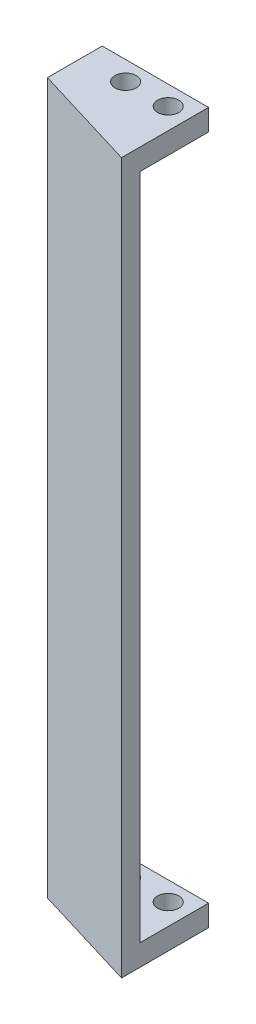
ISO-10303-21;
HEADER;
FILE_DESCRIPTION(('STEP AP214'),'2;1');
FILE_NAME('part.step','',(''),(''),'','','');
FILE_SCHEMA(('AUTOMOTIVE_DESIGN { 1 0 10303 214 1 1 1 1 }'));
ENDSEC;
DATA;
#1=APPLICATION_CONTEXT('core data for automotive mechanical design processes');
#2=APPLICATION_PROTOCOL_DEFINITION('international standard','automotive_design',2000,#1);
#3=PRODUCT_CONTEXT('',#1,'mechanical');
#4=PRODUCT('Part','Part','',(#3));
#5=PRODUCT_RELATED_PRODUCT_CATEGORY('part','',(#4));
#6=PRODUCT_DEFINITION_FORMATION('','',#4);
#7=PRODUCT_DEFINITION_CONTEXT('part definition',#1,'design');
#8=PRODUCT_DEFINITION('design','',#6,#7);
#9=PRODUCT_DEFINITION_SHAPE('','',#8);
#10=(LENGTH_UNIT() NAMED_UNIT(*) SI_UNIT(.MILLI.,.METRE.));
#11=(NAMED_UNIT(*) PLANE_ANGLE_UNIT() SI_UNIT($,.RADIAN.));
#12=(NAMED_UNIT(*) SI_UNIT($,.STERADIAN.) SOLID_ANGLE_UNIT());
#13=UNCERTAINTY_MEASURE_WITH_UNIT(LENGTH_MEASURE(1.E-05),#10,'distance_accuracy_value','');
#14=(GEOMETRIC_REPRESENTATION_CONTEXT(3) GLOBAL_UNCERTAINTY_ASSIGNED_CONTEXT((#13)) GLOBAL_UNIT_ASSIGNED_CONTEXT((#10,
#11,#12)) REPRESENTATION_CONTEXT('',''));
#15=CARTESIAN_POINT('',(0.,0.,0.));
#16=DIRECTION('',(0.,0.,1.));
#17=DIRECTION('',(1.,0.,0.));
#18=AXIS2_PLACEMENT_3D('',#15,#16,#17);
#19=CARTESIAN_POINT('',(0.,3.,0.));
#20=DIRECTION('',(0.,1.,0.));
#21=DIRECTION('',(0.,0.,1.));
#22=AXIS2_PLACEMENT_3D('',#19,#20,#21);
#23=PLANE('',#22);
#24=CARTESIAN_POINT('',(-54.587954734642,3.,-0.793737974361889));
#25=DIRECTION('',(0.,1.,0.));
#26=DIRECTION('',(0.,0.,1.));
#27=AXIS2_PLACEMENT_3D('',#24,#25,#26);
#28=CIRCLE('',#27,1.5);
#29=CARTESIAN_POINT('',(-54.587954734642,3.,0.706262025638108));
#30=VERTEX_POINT('',#29);
#31=EDGE_CURVE('E160',#30,#30,#28,.T.);
#32=ORIENTED_EDGE('',*,*,#31,.F.);
#33=EDGE_LOOP('',(#32));
#34=FACE_BOUND('',#33,.T.);
#35=CARTESIAN_POINT('',(-60.587954734642,3.,-0.793737974361892));
#36=DIRECTION('',(0.,1.,0.));
#37=DIRECTION('',(0.,0.,1.));
#38=AXIS2_PLACEMENT_3D('',#35,#36,#37);
#39=CIRCLE('',#38,1.5);
#40=CARTESIAN_POINT('',(-60.587954734642,3.,0.706262025638105));
#41=VERTEX_POINT('',#40);
#42=EDGE_CURVE('E186',#41,#41,#39,.T.);
#43=ORIENTED_EDGE('',*,*,#42,.F.);
#44=EDGE_LOOP('',(#43));
#45=FACE_BOUND('',#44,.T.);
#46=DIRECTION('',(0.,0.,-1.));
#47=VECTOR('',#46,1.);
#48=CARTESIAN_POINT('',(-64.087954734642,3.,0.));
#49=LINE('',#48,#47);
#50=CARTESIAN_POINT('',(-64.087954734642,3.,2.35261604001609));
#51=VERTEX_POINT('',#50);
#52=CARTESIAN_POINT('',(-64.087954734642,3.,-3.50264174190361));
#53=VERTEX_POINT('',#52);
#54=EDGE_CURVE('E52',#51,#53,#49,.T.);
#55=ORIENTED_EDGE('',*,*,#54,.F.);
#56=DIRECTION('',(0.956868329183458,0.,0.290521945136091));
#57=VECTOR('',#56,1.);
#58=CARTESIAN_POINT('',(-6.06322235186159,3.,19.9699387203809));
#59=LINE('',#58,#57);
#60=CARTESIAN_POINT('',(-51.6186700200398,3.,6.13850876867741));
#61=VERTEX_POINT('',#60);
#62=EDGE_CURVE('E57',#51,#61,#59,.T.);
#63=ORIENTED_EDGE('',*,*,#62,.T.);
#64=DIRECTION('',(0.,0.,-1.));
#65=VECTOR('',#64,1.);
#66=CARTESIAN_POINT('',(-51.6186700200398,3.,8.75119843950533));
#67=LINE('',#66,#65);
#68=CARTESIAN_POINT('',(-51.6186700200398,3.,-3.50264174190359));
#69=VERTEX_POINT('',#68);
#70=EDGE_CURVE('E174',#61,#69,#67,.T.);
#71=ORIENTED_EDGE('',*,*,#70,.T.);
#72=DIRECTION('',(-1.,0.,0.));
#73=VECTOR('',#72,1.);
#74=CARTESIAN_POINT('',(-51.6186700200398,3.,-3.50264174190359));
#75=LINE('',#74,#73);
#76=EDGE_CURVE('E177',#69,#53,#75,.T.);
#77=ORIENTED_EDGE('',*,*,#76,.T.);
#78=EDGE_LOOP('',(#55,#63,#71,#77));
#79=FACE_BOUND('',#78,.T.);
#80=ADVANCED_FACE('F35',(#34,#45,#79),#23,.T.);
#81=CARTESIAN_POINT('',(0.,0.,0.));
#82=DIRECTION('',(0.,1.,0.));
#83=DIRECTION('',(0.,0.,1.));
#84=AXIS2_PLACEMENT_3D('',#81,#82,#83);
#85=PLANE('',#84);
#86=DIRECTION('',(0.956868329183458,0.,0.290521945136091));
#87=VECTOR('',#86,1.);
#88=CARTESIAN_POINT('',(-66.587954734642,0.,4.20626202563812));
#89=LINE('',#88,#87);
#90=CARTESIAN_POINT('',(-66.587954734642,0.,4.20626202563812));
#91=VERTEX_POINT('',#90);
#92=CARTESIAN_POINT('',(-51.6186700200398,0.,8.75119843950533));
#93=VERTEX_POINT('',#92);
#94=EDGE_CURVE('E156',#91,#93,#89,.T.);
#95=ORIENTED_EDGE('',*,*,#94,.F.);
#96=DIRECTION('',(0.,0.,1.));
#97=VECTOR('',#96,1.);
#98=CARTESIAN_POINT('',(-66.587954734642,0.,-3.50264174190362));
#99=LINE('',#98,#97);
#100=CARTESIAN_POINT('',(-66.587954734642,0.,-3.50264174190362));
#101=VERTEX_POINT('',#100);
#102=EDGE_CURVE('E172',#101,#91,#99,.T.);
#103=ORIENTED_EDGE('',*,*,#102,.F.);
#104=DIRECTION('',(-1.,0.,0.));
#105=VECTOR('',#104,1.);
#106=CARTESIAN_POINT('',(-51.6186700200398,0.,-3.50264174190359));
#107=LINE('',#106,#105);
#108=CARTESIAN_POINT('',(-51.6186700200398,0.,-3.50264174190359));
#109=VERTEX_POINT('',#108);
#110=EDGE_CURVE('E162',#109,#101,#107,.T.);
#111=ORIENTED_EDGE('',*,*,#110,.F.);
#112=DIRECTION('',(0.,0.,-1.));
#113=VECTOR('',#112,1.);
#114=CARTESIAN_POINT('',(-51.6186700200398,0.,8.75119843950533));
#115=LINE('',#114,#113);
#116=EDGE_CURVE('E151',#93,#109,#115,.T.);
#117=ORIENTED_EDGE('',*,*,#116,.F.);
#118=EDGE_LOOP('',(#95,#103,#111,#117));
#119=FACE_BOUND('',#118,.T.);
#120=CARTESIAN_POINT('',(-54.587954734642,0.,-0.793737974361889));
#121=DIRECTION('',(0.,1.,0.));
#122=DIRECTION('',(0.,0.,1.));
#123=AXIS2_PLACEMENT_3D('',#120,#121,#122);
#124=CIRCLE('',#123,1.5);
#125=CARTESIAN_POINT('',(-54.587954734642,0.,0.706262025638108));
#126=VERTEX_POINT('',#125);
#127=EDGE_CURVE('E165',#126,#126,#124,.T.);
#128=ORIENTED_EDGE('',*,*,#127,.T.);
#129=EDGE_LOOP('',(#128));
#130=FACE_BOUND('',#129,.T.);
#131=CARTESIAN_POINT('',(-60.587954734642,0.,-0.793737974361892));
#132=DIRECTION('',(0.,1.,0.));
#133=DIRECTION('',(0.,0.,1.));
#134=AXIS2_PLACEMENT_3D('',#131,#132,#133);
#135=CIRCLE('',#134,1.5);
#136=CARTESIAN_POINT('',(-60.587954734642,0.,0.706262025638105));
#137=VERTEX_POINT('',#136);
#138=EDGE_CURVE('E188',#137,#137,#135,.T.);
#139=ORIENTED_EDGE('',*,*,#138,.T.);
#140=EDGE_LOOP('',(#139));
#141=FACE_BOUND('',#140,.T.);
#142=ADVANCED_FACE('F216',(#119,#130,#141),#85,.F.);
#143=CARTESIAN_POINT('',(-66.587954734642,3.,4.20626202563812));
#144=DIRECTION('',(0.290521945136091,0.,-0.956868329183458));
#145=DIRECTION('',(-0.956868329183458,0.,-0.290521945136091));
#146=AXIS2_PLACEMENT_3D('',#143,#144,#145);
#147=PLANE('',#146);
#148=ORIENTED_EDGE('',*,*,#94,.T.);
#149=DIRECTION('',(0.,-1.,0.));
#150=VECTOR('',#149,1.);
#151=CARTESIAN_POINT('',(-51.6186700200398,3.,8.75119843950533));
#152=LINE('',#151,#150);
#153=CARTESIAN_POINT('',(-51.6186700200398,100.,8.75119843950533));
#154=VERTEX_POINT('',#153);
#155=EDGE_CURVE('E11',#154,#93,#152,.T.);
#156=ORIENTED_EDGE('',*,*,#155,.F.);
#157=DIRECTION('',(0.956868329183458,0.,0.290521945136091));
#158=VECTOR('',#157,1.);
#159=CARTESIAN_POINT('',(-66.587954734642,100.,4.20626202563812));
#160=LINE('',#159,#158);
#161=CARTESIAN_POINT('',(-66.587954734642,100.,4.20626202563812));
#162=VERTEX_POINT('',#161);
#163=EDGE_CURVE('E138',#162,#154,#160,.T.);
#164=ORIENTED_EDGE('',*,*,#163,.F.);
#165=DIRECTION('',(0.,-1.,0.));
#166=VECTOR('',#165,1.);
#167=CARTESIAN_POINT('',(-66.587954734642,3.,4.20626202563812));
#168=LINE('',#167,#166);
#169=EDGE_CURVE('E157',#162,#91,#168,.T.);
#170=ORIENTED_EDGE('',*,*,#169,.T.);
#171=EDGE_LOOP('',(#148,#156,#164,#170));
#172=FACE_BOUND('',#171,.T.);
#173=ADVANCED_FACE('F37',(#172),#147,.F.);
#174=CARTESIAN_POINT('',(-51.6186700200398,3.,8.75119843950533));
#175=DIRECTION('',(-1.,0.,0.));
#176=DIRECTION('',(0.,0.,1.));
#177=AXIS2_PLACEMENT_3D('',#174,#175,#176);
#178=PLANE('',#177);
#179=ORIENTED_EDGE('',*,*,#116,.T.);
#180=DIRECTION('',(0.,-1.,0.));
#181=VECTOR('',#180,1.);
#182=CARTESIAN_POINT('',(-51.6186700200398,3.,-3.50264174190359));
#183=LINE('',#182,#181);
#184=EDGE_CURVE('E44',#69,#109,#183,.T.);
#185=ORIENTED_EDGE('',*,*,#184,.F.);
#186=ORIENTED_EDGE('',*,*,#70,.F.);
#187=DIRECTION('',(0.,-1.,0.));
#188=VECTOR('',#187,1.);
#189=CARTESIAN_POINT('',(-51.6186700200398,97.,6.13850876867741));
#190=LINE('',#189,#188);
#191=CARTESIAN_POINT('',(-51.6186700200398,97.,6.13850876867741));
#192=VERTEX_POINT('',#191);
#193=EDGE_CURVE('E107',#192,#61,#190,.T.);
#194=ORIENTED_EDGE('',*,*,#193,.F.);
#195=DIRECTION('',(0.,0.,-1.));
#196=VECTOR('',#195,1.);
#197=CARTESIAN_POINT('',(-51.6186700200398,97.,8.75119843950533));
#198=LINE('',#197,#196);
#199=CARTESIAN_POINT('',(-51.6186700200398,97.,-3.50264174190359));
#200=VERTEX_POINT('',#199);
#201=EDGE_CURVE('E100',#192,#200,#198,.T.);
#202=ORIENTED_EDGE('',*,*,#201,.T.);
#203=DIRECTION('',(0.,1.,0.));
#204=VECTOR('',#203,1.);
#205=CARTESIAN_POINT('',(-51.6186700200398,97.,-3.50264174190359));
#206=LINE('',#205,#204);
#207=CARTESIAN_POINT('',(-51.6186700200398,100.,-3.50264174190359));
#208=VERTEX_POINT('',#207);
#209=EDGE_CURVE('E104',#200,#208,#206,.T.);
#210=ORIENTED_EDGE('',*,*,#209,.T.);
#211=DIRECTION('',(0.,0.,-1.));
#212=VECTOR('',#211,1.);
#213=CARTESIAN_POINT('',(-51.6186700200398,100.,8.75119843950533));
#214=LINE('',#213,#212);
#215=EDGE_CURVE('E126',#154,#208,#214,.T.);
#216=ORIENTED_EDGE('',*,*,#215,.F.);
#217=ORIENTED_EDGE('',*,*,#155,.T.);
#218=EDGE_LOOP('',(#179,#185,#186,#194,#202,#210,#216,#217));
#219=FACE_BOUND('',#218,.T.);
#220=ADVANCED_FACE('F102',(#219),#178,.F.);
#221=CARTESIAN_POINT('',(-51.6186700200398,3.,-3.50264174190359));
#222=DIRECTION('',(0.,0.,1.));
#223=DIRECTION('',(1.,0.,0.));
#224=AXIS2_PLACEMENT_3D('',#221,#222,#223);
#225=PLANE('',#224);
#226=ORIENTED_EDGE('',*,*,#110,.T.);
#227=DIRECTION('',(0.,-1.,0.));
#228=VECTOR('',#227,1.);
#229=CARTESIAN_POINT('',(-66.587954734642,3.,-3.50264174190362));
#230=LINE('',#229,#228);
#231=CARTESIAN_POINT('',(-66.587954734642,100.,-3.50264174190362));
#232=VERTEX_POINT('',#231);
#233=EDGE_CURVE('E176',#232,#101,#230,.T.);
#234=ORIENTED_EDGE('',*,*,#233,.F.);
#235=DIRECTION('',(-1.,0.,0.));
#236=VECTOR('',#235,1.);
#237=CARTESIAN_POINT('',(-51.6186700200398,100.,-3.50264174190359));
#238=LINE('',#237,#236);
#239=EDGE_CURVE('E119',#208,#232,#238,.T.);
#240=ORIENTED_EDGE('',*,*,#239,.F.);
#241=ORIENTED_EDGE('',*,*,#209,.F.);
#242=DIRECTION('',(-1.,0.,0.));
#243=VECTOR('',#242,1.);
#244=CARTESIAN_POINT('',(-51.6186700200398,97.,-3.50264174190359));
#245=LINE('',#244,#243);
#246=CARTESIAN_POINT('',(-64.087954734642,97.,-3.50264174190361));
#247=VERTEX_POINT('',#246);
#248=EDGE_CURVE('E112',#200,#247,#245,.T.);
#249=ORIENTED_EDGE('',*,*,#248,.T.);
#250=DIRECTION('',(0.,-1.,0.));
#251=VECTOR('',#250,1.);
#252=CARTESIAN_POINT('',(-64.087954734642,97.,-3.50264174190361));
#253=LINE('',#252,#251);
#254=EDGE_CURVE('E195',#247,#53,#253,.T.);
#255=ORIENTED_EDGE('',*,*,#254,.T.);
#256=ORIENTED_EDGE('',*,*,#76,.F.);
#257=ORIENTED_EDGE('',*,*,#184,.T.);
#258=EDGE_LOOP('',(#226,#234,#240,#241,#249,#255,#256,#257));
#259=FACE_BOUND('',#258,.T.);
#260=ADVANCED_FACE('F116',(#259),#225,.F.);
#261=CARTESIAN_POINT('',(-66.587954734642,3.,-3.50264174190362));
#262=DIRECTION('',(1.,0.,0.));
#263=DIRECTION('',(0.,0.,-1.));
#264=AXIS2_PLACEMENT_3D('',#261,#262,#263);
#265=PLANE('',#264);
#266=ORIENTED_EDGE('',*,*,#102,.T.);
#267=ORIENTED_EDGE('',*,*,#169,.F.);
#268=DIRECTION('',(0.,0.,1.));
#269=VECTOR('',#268,1.);
#270=CARTESIAN_POINT('',(-66.587954734642,100.,-3.50264174190362));
#271=LINE('',#270,#269);
#272=EDGE_CURVE('E141',#232,#162,#271,.T.);
#273=ORIENTED_EDGE('',*,*,#272,.F.);
#274=ORIENTED_EDGE('',*,*,#233,.T.);
#275=EDGE_LOOP('',(#266,#267,#273,#274));
#276=FACE_BOUND('',#275,.T.);
#277=ADVANCED_FACE('F229',(#276),#265,.F.);
#278=CARTESIAN_POINT('',(-54.587954734642,3.,-0.793737974361889));
#279=DIRECTION('',(0.,-1.,0.));
#280=DIRECTION('',(0.,0.,-1.));
#281=AXIS2_PLACEMENT_3D('',#278,#279,#280);
#282=CYLINDRICAL_SURFACE('',#281,1.5);
#283=ORIENTED_EDGE('',*,*,#31,.T.);
#284=EDGE_LOOP('',(#283));
#285=FACE_BOUND('',#284,.T.);
#286=ORIENTED_EDGE('',*,*,#127,.F.);
#287=EDGE_LOOP('',(#286));
#288=FACE_BOUND('',#287,.T.);
#289=ADVANCED_FACE('F226',(#285,#288),#282,.F.);
#290=CARTESIAN_POINT('',(-60.587954734642,3.,-0.793737974361892));
#291=DIRECTION('',(0.,-1.,0.));
#292=DIRECTION('',(0.,0.,-1.));
#293=AXIS2_PLACEMENT_3D('',#290,#291,#292);
#294=CYLINDRICAL_SURFACE('',#293,1.5);
#295=ORIENTED_EDGE('',*,*,#42,.T.);
#296=EDGE_LOOP('',(#295));
#297=FACE_BOUND('',#296,.T.);
#298=ORIENTED_EDGE('',*,*,#138,.F.);
#299=EDGE_LOOP('',(#298));
#300=FACE_BOUND('',#299,.T.);
#301=ADVANCED_FACE('F254',(#297,#300),#294,.F.);
#302=CARTESIAN_POINT('',(-6.06322235186159,97.,19.9699387203809));
#303=DIRECTION('',(0.290521945136091,0.,-0.956868329183458));
#304=DIRECTION('',(-0.956868329183458,0.,-0.290521945136091));
#305=AXIS2_PLACEMENT_3D('',#302,#303,#304);
#306=PLANE('',#305);
#307=ORIENTED_EDGE('',*,*,#62,.F.);
#308=DIRECTION('',(0.,-1.,0.));
#309=VECTOR('',#308,1.);
#310=CARTESIAN_POINT('',(-64.087954734642,97.,2.35261604001609));
#311=LINE('',#310,#309);
#312=CARTESIAN_POINT('',(-64.087954734642,97.,2.35261604001609));
#313=VERTEX_POINT('',#312);
#314=EDGE_CURVE('E191',#313,#51,#311,.T.);
#315=ORIENTED_EDGE('',*,*,#314,.F.);
#316=DIRECTION('',(0.956868329183458,0.,0.290521945136091));
#317=VECTOR('',#316,1.);
#318=CARTESIAN_POINT('',(-6.06322235186159,97.,19.9699387203809));
#319=LINE('',#318,#317);
#320=EDGE_CURVE('E199',#313,#192,#319,.T.);
#321=ORIENTED_EDGE('',*,*,#320,.T.);
#322=ORIENTED_EDGE('',*,*,#193,.T.);
#323=EDGE_LOOP('',(#307,#315,#321,#322));
#324=FACE_BOUND('',#323,.T.);
#325=ADVANCED_FACE('F210',(#324),#306,.T.);
#326=CARTESIAN_POINT('',(-64.087954734642,97.,0.));
#327=DIRECTION('',(-1.,0.,0.));
#328=DIRECTION('',(0.,0.,1.));
#329=AXIS2_PLACEMENT_3D('',#326,#327,#328);
#330=PLANE('',#329);
#331=ORIENTED_EDGE('',*,*,#54,.T.);
#332=ORIENTED_EDGE('',*,*,#254,.F.);
#333=DIRECTION('',(0.,0.,-1.));
#334=VECTOR('',#333,1.);
#335=CARTESIAN_POINT('',(-64.087954734642,97.,0.));
#336=LINE('',#335,#334);
#337=EDGE_CURVE('E125',#313,#247,#336,.T.);
#338=ORIENTED_EDGE('',*,*,#337,.F.);
#339=ORIENTED_EDGE('',*,*,#314,.T.);
#340=EDGE_LOOP('',(#331,#332,#338,#339));
#341=FACE_BOUND('',#340,.T.);
#342=ADVANCED_FACE('F212',(#341),#330,.F.);
#343=CARTESIAN_POINT('',(0.,97.,0.));
#344=DIRECTION('',(0.,-1.,0.));
#345=DIRECTION('',(0.,0.,1.));
#346=AXIS2_PLACEMENT_3D('',#343,#344,#345);
#347=PLANE('',#346);
#348=CARTESIAN_POINT('',(-54.587954734642,97.,-0.793737974361889));
#349=DIRECTION('',(0.,1.,0.));
#350=DIRECTION('',(0.,0.,1.));
#351=AXIS2_PLACEMENT_3D('',#348,#349,#350);
#352=CIRCLE('',#351,1.5);
#353=CARTESIAN_POINT('',(-54.587954734642,97.,0.706262025638108));
#354=VERTEX_POINT('',#353);
#355=EDGE_CURVE('E142',#354,#354,#352,.T.);
#356=ORIENTED_EDGE('',*,*,#355,.T.);
#357=EDGE_LOOP('',(#356));
#358=FACE_BOUND('',#357,.T.);
#359=CARTESIAN_POINT('',(-60.587954734642,97.,-0.793737974361892));
#360=DIRECTION('',(0.,1.,0.));
#361=DIRECTION('',(0.,0.,1.));
#362=AXIS2_PLACEMENT_3D('',#359,#360,#361);
#363=CIRCLE('',#362,1.5);
#364=CARTESIAN_POINT('',(-60.587954734642,97.,0.706262025638105));
#365=VERTEX_POINT('',#364);
#366=EDGE_CURVE('E386',#365,#365,#363,.T.);
#367=ORIENTED_EDGE('',*,*,#366,.T.);
#368=EDGE_LOOP('',(#367));
#369=FACE_BOUND('',#368,.T.);
#370=ORIENTED_EDGE('',*,*,#320,.F.);
#371=ORIENTED_EDGE('',*,*,#337,.T.);
#372=ORIENTED_EDGE('',*,*,#248,.F.);
#373=ORIENTED_EDGE('',*,*,#201,.F.);
#374=EDGE_LOOP('',(#370,#371,#372,#373));
#375=FACE_BOUND('',#374,.T.);
#376=ADVANCED_FACE('F123',(#358,#369,#375),#347,.T.);
#377=CARTESIAN_POINT('',(0.,100.,0.));
#378=DIRECTION('',(0.,-1.,0.));
#379=DIRECTION('',(0.,0.,1.));
#380=AXIS2_PLACEMENT_3D('',#377,#378,#379);
#381=PLANE('',#380);
#382=CARTESIAN_POINT('',(-60.587954734642,100.,-0.793737974361892));
#383=DIRECTION('',(0.,1.,0.));
#384=DIRECTION('',(0.,0.,1.));
#385=AXIS2_PLACEMENT_3D('',#382,#383,#384);
#386=CIRCLE('',#385,1.5);
#387=CARTESIAN_POINT('',(-60.587954734642,100.,0.706262025638105));
#388=VERTEX_POINT('',#387);
#389=EDGE_CURVE('E389',#388,#388,#386,.T.);
#390=ORIENTED_EDGE('',*,*,#389,.F.);
#391=EDGE_LOOP('',(#390));
#392=FACE_BOUND('',#391,.T.);
#393=CARTESIAN_POINT('',(-54.587954734642,100.,-0.793737974361889));
#394=DIRECTION('',(0.,1.,0.));
#395=DIRECTION('',(0.,0.,1.));
#396=AXIS2_PLACEMENT_3D('',#393,#394,#395);
#397=CIRCLE('',#396,1.5);
#398=CARTESIAN_POINT('',(-54.587954734642,100.,0.706262025638108));
#399=VERTEX_POINT('',#398);
#400=EDGE_CURVE('E134',#399,#399,#397,.T.);
#401=ORIENTED_EDGE('',*,*,#400,.F.);
#402=EDGE_LOOP('',(#401));
#403=FACE_BOUND('',#402,.T.);
#404=ORIENTED_EDGE('',*,*,#163,.T.);
#405=ORIENTED_EDGE('',*,*,#215,.T.);
#406=ORIENTED_EDGE('',*,*,#239,.T.);
#407=ORIENTED_EDGE('',*,*,#272,.T.);
#408=EDGE_LOOP('',(#404,#405,#406,#407));
#409=FACE_BOUND('',#408,.T.);
#410=ADVANCED_FACE('F146',(#392,#403,#409),#381,.F.);
#411=CARTESIAN_POINT('',(-54.587954734642,97.,-0.793737974361889));
#412=DIRECTION('',(0.,1.,0.));
#413=DIRECTION('',(0.,0.,1.));
#414=AXIS2_PLACEMENT_3D('',#411,#412,#413);
#415=CYLINDRICAL_SURFACE('',#414,1.5);
#416=ORIENTED_EDGE('',*,*,#355,.F.);
#417=EDGE_LOOP('',(#416));
#418=FACE_BOUND('',#417,.T.);
#419=ORIENTED_EDGE('',*,*,#400,.T.);
#420=EDGE_LOOP('',(#419));
#421=FACE_BOUND('',#420,.T.);
#422=ADVANCED_FACE('F359',(#418,#421),#415,.F.);
#423=CARTESIAN_POINT('',(-60.587954734642,97.,-0.793737974361892));
#424=DIRECTION('',(0.,1.,0.));
#425=DIRECTION('',(0.,0.,1.));
#426=AXIS2_PLACEMENT_3D('',#423,#424,#425);
#427=CYLINDRICAL_SURFACE('',#426,1.5);
#428=ORIENTED_EDGE('',*,*,#366,.F.);
#429=EDGE_LOOP('',(#428));
#430=FACE_BOUND('',#429,.T.);
#431=ORIENTED_EDGE('',*,*,#389,.T.);
#432=EDGE_LOOP('',(#431));
#433=FACE_BOUND('',#432,.T.);
#434=ADVANCED_FACE('F369',(#430,#433),#427,.F.);
#435=CLOSED_SHELL('',(#80,#142,#173,#220,#260,#277,#289,#301,#325,#342,#376,#410,#422,#434));
#436=MANIFOLD_SOLID_BREP('B2',#435);
#437=ADVANCED_BREP_SHAPE_REPRESENTATION('',(#18,#436),#14);
#438=SHAPE_DEFINITION_REPRESENTATION(#9,#437);
ENDSEC;
END-ISO-10303-21;
